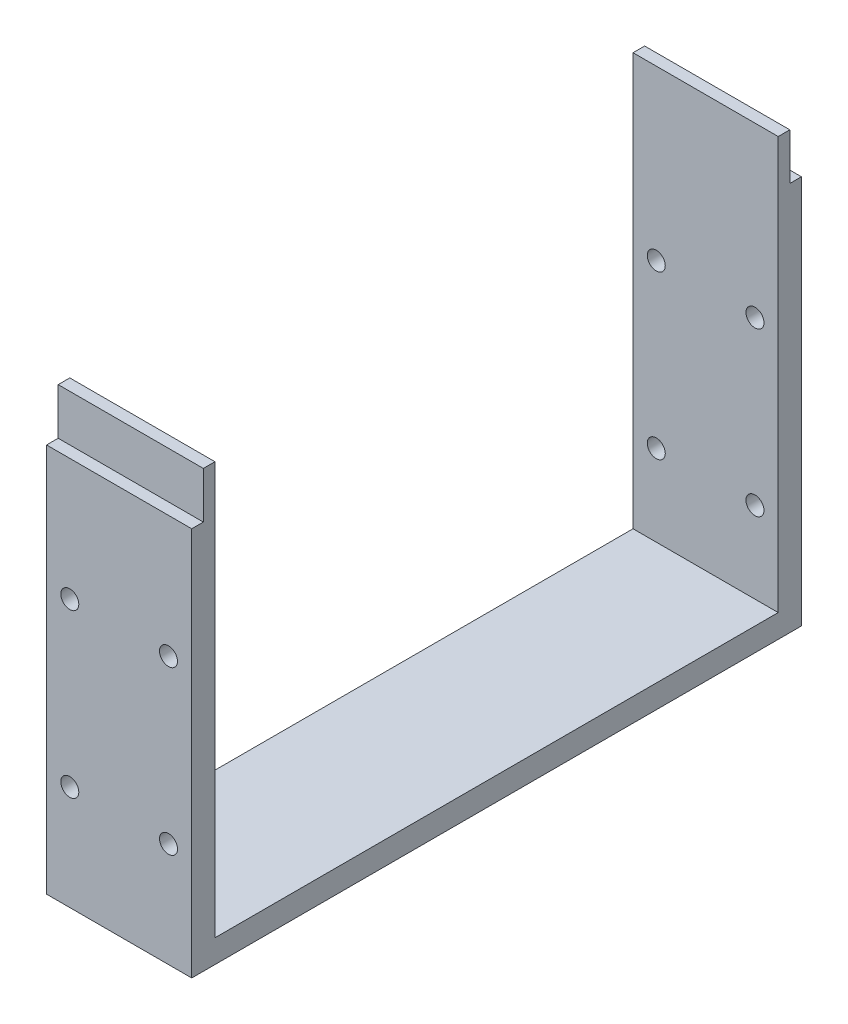
ISO-10303-21;
HEADER;
FILE_DESCRIPTION(('STEP AP214'),'2;1');
FILE_NAME('part.step','',(''),(''),'','','');
FILE_SCHEMA(('AUTOMOTIVE_DESIGN { 1 0 10303 214 1 1 1 1 }'));
ENDSEC;
DATA;
#1=APPLICATION_CONTEXT('core data for automotive mechanical design processes');
#2=APPLICATION_PROTOCOL_DEFINITION('international standard','automotive_design',2000,#1);
#3=PRODUCT_CONTEXT('',#1,'mechanical');
#4=PRODUCT('Part','Part','',(#3));
#5=PRODUCT_RELATED_PRODUCT_CATEGORY('part','',(#4));
#6=PRODUCT_DEFINITION_FORMATION('','',#4);
#7=PRODUCT_DEFINITION_CONTEXT('part definition',#1,'design');
#8=PRODUCT_DEFINITION('design','',#6,#7);
#9=PRODUCT_DEFINITION_SHAPE('','',#8);
#10=(LENGTH_UNIT() NAMED_UNIT(*) SI_UNIT(.MILLI.,.METRE.));
#11=(NAMED_UNIT(*) PLANE_ANGLE_UNIT() SI_UNIT($,.RADIAN.));
#12=(NAMED_UNIT(*) SI_UNIT($,.STERADIAN.) SOLID_ANGLE_UNIT());
#13=UNCERTAINTY_MEASURE_WITH_UNIT(LENGTH_MEASURE(1.E-05),#10,'distance_accuracy_value','');
#14=(GEOMETRIC_REPRESENTATION_CONTEXT(3) GLOBAL_UNCERTAINTY_ASSIGNED_CONTEXT((#13)) GLOBAL_UNIT_ASSIGNED_CONTEXT((#10,
#11,#12)) REPRESENTATION_CONTEXT('',''));
#15=CARTESIAN_POINT('',(0.,0.,0.));
#16=DIRECTION('',(0.,0.,1.));
#17=DIRECTION('',(1.,0.,0.));
#18=AXIS2_PLACEMENT_3D('',#15,#16,#17);
#19=CARTESIAN_POINT('',(12.5,65.,0.));
#20=DIRECTION('',(0.,-1.,0.));
#21=DIRECTION('',(0.,0.,-1.));
#22=AXIS2_PLACEMENT_3D('',#19,#20,#21);
#23=PLANE('',#22);
#24=DIRECTION('',(-1.,0.,0.));
#25=VECTOR('',#24,1.);
#26=CARTESIAN_POINT('',(12.5,65.,-50.5));
#27=LINE('',#26,#25);
#28=CARTESIAN_POINT('',(12.5,65.,-50.5));
#29=VERTEX_POINT('',#28);
#30=CARTESIAN_POINT('',(-12.5,65.,-50.5));
#31=VERTEX_POINT('',#30);
#32=EDGE_CURVE('E12',#29,#31,#27,.T.);
#33=ORIENTED_EDGE('',*,*,#32,.F.);
#34=DIRECTION('',(0.,0.,1.));
#35=VECTOR('',#34,1.);
#36=CARTESIAN_POINT('',(12.5,65.,0.));
#37=LINE('',#36,#35);
#38=CARTESIAN_POINT('',(12.5,65.,-52.5));
#39=VERTEX_POINT('',#38);
#40=EDGE_CURVE('E300',#39,#29,#37,.T.);
#41=ORIENTED_EDGE('',*,*,#40,.F.);
#42=DIRECTION('',(-1.,0.,0.));
#43=VECTOR('',#42,1.);
#44=CARTESIAN_POINT('',(12.5,65.,-52.5));
#45=LINE('',#44,#43);
#46=CARTESIAN_POINT('',(-12.5,65.,-52.5));
#47=VERTEX_POINT('',#46);
#48=EDGE_CURVE('E216',#39,#47,#45,.T.);
#49=ORIENTED_EDGE('',*,*,#48,.T.);
#50=DIRECTION('',(0.,0.,1.));
#51=VECTOR('',#50,1.);
#52=CARTESIAN_POINT('',(-12.5,65.,0.));
#53=LINE('',#52,#51);
#54=EDGE_CURVE('E182',#47,#31,#53,.T.);
#55=ORIENTED_EDGE('',*,*,#54,.T.);
#56=EDGE_LOOP('',(#33,#41,#49,#55));
#57=FACE_BOUND('',#56,.T.);
#58=ADVANCED_FACE('F113',(#57),#23,.F.);
#59=CARTESIAN_POINT('',(12.5,0.,-48.5));
#60=DIRECTION('',(0.,0.,1.));
#61=DIRECTION('',(1.,0.,0.));
#62=AXIS2_PLACEMENT_3D('',#59,#60,#61);
#63=PLANE('',#62);
#64=CARTESIAN_POINT('',(8.5,44.,-48.5));
#65=DIRECTION('',(0.,0.,1.));
#66=DIRECTION('',(1.,0.,0.));
#67=AXIS2_PLACEMENT_3D('',#64,#65,#66);
#68=CIRCLE('',#67,1.54999999999994);
#69=CARTESIAN_POINT('',(10.0499999999999,44.,-48.5));
#70=VERTEX_POINT('',#69);
#71=EDGE_CURVE('E194',#70,#70,#68,.T.);
#72=ORIENTED_EDGE('',*,*,#71,.F.);
#73=EDGE_LOOP('',(#72));
#74=FACE_BOUND('',#73,.T.);
#75=CARTESIAN_POINT('',(-8.5,16.,-48.5));
#76=DIRECTION('',(0.,0.,1.));
#77=DIRECTION('',(1.,0.,0.));
#78=AXIS2_PLACEMENT_3D('',#75,#76,#77);
#79=CIRCLE('',#78,1.55);
#80=CARTESIAN_POINT('',(-6.95,16.,-48.5));
#81=VERTEX_POINT('',#80);
#82=EDGE_CURVE('E310',#81,#81,#79,.T.);
#83=ORIENTED_EDGE('',*,*,#82,.F.);
#84=EDGE_LOOP('',(#83));
#85=FACE_BOUND('',#84,.T.);
#86=CARTESIAN_POINT('',(-8.5,44.,-48.5));
#87=DIRECTION('',(0.,0.,1.));
#88=DIRECTION('',(1.,0.,0.));
#89=AXIS2_PLACEMENT_3D('',#86,#87,#88);
#90=CIRCLE('',#89,1.54999999999994);
#91=CARTESIAN_POINT('',(-6.95000000000006,44.,-48.5));
#92=VERTEX_POINT('',#91);
#93=EDGE_CURVE('E318',#92,#92,#90,.T.);
#94=ORIENTED_EDGE('',*,*,#93,.F.);
#95=EDGE_LOOP('',(#94));
#96=FACE_BOUND('',#95,.T.);
#97=CARTESIAN_POINT('',(8.5,16.,-48.5));
#98=DIRECTION('',(0.,0.,1.));
#99=DIRECTION('',(1.,0.,0.));
#100=AXIS2_PLACEMENT_3D('',#97,#98,#99);
#101=CIRCLE('',#100,1.55);
#102=CARTESIAN_POINT('',(10.05,16.,-48.5));
#103=VERTEX_POINT('',#102);
#104=EDGE_CURVE('E326',#103,#103,#101,.T.);
#105=ORIENTED_EDGE('',*,*,#104,.F.);
#106=EDGE_LOOP('',(#105));
#107=FACE_BOUND('',#106,.T.);
#108=DIRECTION('',(0.,1.,0.));
#109=VECTOR('',#108,1.);
#110=CARTESIAN_POINT('',(-12.5,0.,-48.5));
#111=LINE('',#110,#109);
#112=CARTESIAN_POINT('',(-12.5,2.,-48.5));
#113=VERTEX_POINT('',#112);
#114=CARTESIAN_POINT('',(-12.5,73.,-48.5));
#115=VERTEX_POINT('',#114);
#116=EDGE_CURVE('E169',#113,#115,#111,.T.);
#117=ORIENTED_EDGE('',*,*,#116,.F.);
#118=DIRECTION('',(-1.,0.,0.));
#119=VECTOR('',#118,1.);
#120=CARTESIAN_POINT('',(12.5,2.,-48.5));
#121=LINE('',#120,#119);
#122=CARTESIAN_POINT('',(12.5,2.,-48.5));
#123=VERTEX_POINT('',#122);
#124=EDGE_CURVE('E236',#123,#113,#121,.T.);
#125=ORIENTED_EDGE('',*,*,#124,.F.);
#126=DIRECTION('',(0.,1.,0.));
#127=VECTOR('',#126,1.);
#128=CARTESIAN_POINT('',(12.5,0.,-48.5));
#129=LINE('',#128,#127);
#130=CARTESIAN_POINT('',(12.5,73.,-48.5));
#131=VERTEX_POINT('',#130);
#132=EDGE_CURVE('E188',#123,#131,#129,.T.);
#133=ORIENTED_EDGE('',*,*,#132,.T.);
#134=DIRECTION('',(-1.,0.,0.));
#135=VECTOR('',#134,1.);
#136=CARTESIAN_POINT('',(12.5,73.,-48.5));
#137=LINE('',#136,#135);
#138=EDGE_CURVE('E185',#131,#115,#137,.T.);
#139=ORIENTED_EDGE('',*,*,#138,.T.);
#140=EDGE_LOOP('',(#117,#125,#133,#139));
#141=FACE_BOUND('',#140,.T.);
#142=ADVANCED_FACE('F186',(#74,#85,#96,#107,#141),#63,.T.);
#143=CARTESIAN_POINT('',(12.5,2.,0.));
#144=DIRECTION('',(0.,1.,0.));
#145=DIRECTION('',(0.,0.,1.));
#146=AXIS2_PLACEMENT_3D('',#143,#144,#145);
#147=PLANE('',#146);
#148=DIRECTION('',(0.,0.,-1.));
#149=VECTOR('',#148,1.);
#150=CARTESIAN_POINT('',(-12.5,2.,0.));
#151=LINE('',#150,#149);
#152=CARTESIAN_POINT('',(-12.5,2.,48.5));
#153=VERTEX_POINT('',#152);
#154=EDGE_CURVE('E178',#153,#113,#151,.T.);
#155=ORIENTED_EDGE('',*,*,#154,.F.);
#156=DIRECTION('',(-1.,0.,0.));
#157=VECTOR('',#156,1.);
#158=CARTESIAN_POINT('',(12.5,2.,48.5));
#159=LINE('',#158,#157);
#160=CARTESIAN_POINT('',(12.5,2.,48.5));
#161=VERTEX_POINT('',#160);
#162=EDGE_CURVE('E240',#161,#153,#159,.T.);
#163=ORIENTED_EDGE('',*,*,#162,.F.);
#164=DIRECTION('',(0.,0.,-1.));
#165=VECTOR('',#164,1.);
#166=CARTESIAN_POINT('',(12.5,2.,0.));
#167=LINE('',#166,#165);
#168=EDGE_CURVE('E294',#161,#123,#167,.T.);
#169=ORIENTED_EDGE('',*,*,#168,.T.);
#170=ORIENTED_EDGE('',*,*,#124,.T.);
#171=EDGE_LOOP('',(#155,#163,#169,#170));
#172=FACE_BOUND('',#171,.T.);
#173=ADVANCED_FACE('F436',(#172),#147,.T.);
#174=CARTESIAN_POINT('',(12.5,0.,48.5));
#175=DIRECTION('',(0.,0.,1.));
#176=DIRECTION('',(1.,0.,0.));
#177=AXIS2_PLACEMENT_3D('',#174,#175,#176);
#178=PLANE('',#177);
#179=CARTESIAN_POINT('',(8.5,44.,48.5));
#180=DIRECTION('',(0.,0.,1.));
#181=DIRECTION('',(1.,0.,0.));
#182=AXIS2_PLACEMENT_3D('',#179,#180,#181);
#183=CIRCLE('',#182,1.54999999999994);
#184=CARTESIAN_POINT('',(10.0499999999999,44.,48.5));
#185=VERTEX_POINT('',#184);
#186=EDGE_CURVE('E201',#185,#185,#183,.T.);
#187=ORIENTED_EDGE('',*,*,#186,.T.);
#188=EDGE_LOOP('',(#187));
#189=FACE_BOUND('',#188,.T.);
#190=CARTESIAN_POINT('',(-8.5,16.,48.5));
#191=DIRECTION('',(0.,0.,1.));
#192=DIRECTION('',(1.,0.,0.));
#193=AXIS2_PLACEMENT_3D('',#190,#191,#192);
#194=CIRCLE('',#193,1.55);
#195=CARTESIAN_POINT('',(-6.95,16.,48.5));
#196=VERTEX_POINT('',#195);
#197=EDGE_CURVE('E314',#196,#196,#194,.T.);
#198=ORIENTED_EDGE('',*,*,#197,.T.);
#199=EDGE_LOOP('',(#198));
#200=FACE_BOUND('',#199,.T.);
#201=CARTESIAN_POINT('',(-8.5,44.,48.5));
#202=DIRECTION('',(0.,0.,1.));
#203=DIRECTION('',(1.,0.,0.));
#204=AXIS2_PLACEMENT_3D('',#201,#202,#203);
#205=CIRCLE('',#204,1.54999999999994);
#206=CARTESIAN_POINT('',(-6.95000000000006,44.,48.5));
#207=VERTEX_POINT('',#206);
#208=EDGE_CURVE('E322',#207,#207,#205,.T.);
#209=ORIENTED_EDGE('',*,*,#208,.T.);
#210=EDGE_LOOP('',(#209));
#211=FACE_BOUND('',#210,.T.);
#212=CARTESIAN_POINT('',(8.5,16.,48.5));
#213=DIRECTION('',(0.,0.,1.));
#214=DIRECTION('',(1.,0.,0.));
#215=AXIS2_PLACEMENT_3D('',#212,#213,#214);
#216=CIRCLE('',#215,1.55);
#217=CARTESIAN_POINT('',(10.05,16.,48.5));
#218=VERTEX_POINT('',#217);
#219=EDGE_CURVE('E330',#218,#218,#216,.T.);
#220=ORIENTED_EDGE('',*,*,#219,.T.);
#221=EDGE_LOOP('',(#220));
#222=FACE_BOUND('',#221,.T.);
#223=DIRECTION('',(0.,1.,0.));
#224=VECTOR('',#223,1.);
#225=CARTESIAN_POINT('',(-12.5,0.,48.5));
#226=LINE('',#225,#224);
#227=CARTESIAN_POINT('',(-12.5,73.,48.5));
#228=VERTEX_POINT('',#227);
#229=EDGE_CURVE('E270',#153,#228,#226,.T.);
#230=ORIENTED_EDGE('',*,*,#229,.T.);
#231=DIRECTION('',(-1.,0.,0.));
#232=VECTOR('',#231,1.);
#233=CARTESIAN_POINT('',(12.5,73.,48.5));
#234=LINE('',#233,#232);
#235=CARTESIAN_POINT('',(12.5,73.,48.5));
#236=VERTEX_POINT('',#235);
#237=EDGE_CURVE('E213',#236,#228,#234,.T.);
#238=ORIENTED_EDGE('',*,*,#237,.F.);
#239=DIRECTION('',(0.,1.,0.));
#240=VECTOR('',#239,1.);
#241=CARTESIAN_POINT('',(12.5,0.,48.5));
#242=LINE('',#241,#240);
#243=EDGE_CURVE('E291',#161,#236,#242,.T.);
#244=ORIENTED_EDGE('',*,*,#243,.F.);
#245=ORIENTED_EDGE('',*,*,#162,.T.);
#246=EDGE_LOOP('',(#230,#238,#244,#245));
#247=FACE_BOUND('',#246,.T.);
#248=ADVANCED_FACE('F431',(#189,#200,#211,#222,#247),#178,.F.);
#249=CARTESIAN_POINT('',(12.5,65.,0.));
#250=DIRECTION('',(0.,1.,0.));
#251=DIRECTION('',(0.,0.,1.));
#252=AXIS2_PLACEMENT_3D('',#249,#250,#251);
#253=PLANE('',#252);
#254=DIRECTION('',(0.,0.,-1.));
#255=VECTOR('',#254,1.);
#256=CARTESIAN_POINT('',(12.5,65.,0.));
#257=LINE('',#256,#255);
#258=CARTESIAN_POINT('',(12.5,65.,52.5));
#259=VERTEX_POINT('',#258);
#260=CARTESIAN_POINT('',(12.5,65.,50.5));
#261=VERTEX_POINT('',#260);
#262=EDGE_CURVE('E287',#259,#261,#257,.T.);
#263=ORIENTED_EDGE('',*,*,#262,.T.);
#264=DIRECTION('',(-1.,0.,0.));
#265=VECTOR('',#264,1.);
#266=CARTESIAN_POINT('',(12.5,65.,50.5));
#267=LINE('',#266,#265);
#268=CARTESIAN_POINT('',(-12.5,65.,50.5));
#269=VERTEX_POINT('',#268);
#270=EDGE_CURVE('E124',#261,#269,#267,.T.);
#271=ORIENTED_EDGE('',*,*,#270,.T.);
#272=DIRECTION('',(0.,0.,-1.));
#273=VECTOR('',#272,1.);
#274=CARTESIAN_POINT('',(-12.5,65.,0.));
#275=LINE('',#274,#273);
#276=CARTESIAN_POINT('',(-12.5,65.,52.5));
#277=VERTEX_POINT('',#276);
#278=EDGE_CURVE('E266',#277,#269,#275,.T.);
#279=ORIENTED_EDGE('',*,*,#278,.F.);
#280=DIRECTION('',(-1.,0.,0.));
#281=VECTOR('',#280,1.);
#282=CARTESIAN_POINT('',(12.5,65.,52.5));
#283=LINE('',#282,#281);
#284=EDGE_CURVE('E244',#259,#277,#283,.T.);
#285=ORIENTED_EDGE('',*,*,#284,.F.);
#286=EDGE_LOOP('',(#263,#271,#279,#285));
#287=FACE_BOUND('',#286,.T.);
#288=ADVANCED_FACE('F421',(#287),#253,.T.);
#289=CARTESIAN_POINT('',(12.5,0.,52.5));
#290=DIRECTION('',(0.,0.,-1.));
#291=DIRECTION('',(-1.,0.,0.));
#292=AXIS2_PLACEMENT_3D('',#289,#290,#291);
#293=PLANE('',#292);
#294=CARTESIAN_POINT('',(8.5,44.,52.5));
#295=DIRECTION('',(0.,0.,-1.));
#296=DIRECTION('',(-1.,0.,0.));
#297=AXIS2_PLACEMENT_3D('',#294,#295,#296);
#298=CIRCLE('',#297,1.54999999999994);
#299=CARTESIAN_POINT('',(6.95000000000006,44.,52.5));
#300=VERTEX_POINT('',#299);
#301=EDGE_CURVE('E342',#300,#300,#298,.T.);
#302=ORIENTED_EDGE('',*,*,#301,.T.);
#303=EDGE_LOOP('',(#302));
#304=FACE_BOUND('',#303,.T.);
#305=CARTESIAN_POINT('',(-8.5,16.,52.5));
#306=DIRECTION('',(0.,0.,-1.));
#307=DIRECTION('',(1.,0.,0.));
#308=AXIS2_PLACEMENT_3D('',#305,#306,#307);
#309=CIRCLE('',#308,1.55);
#310=CARTESIAN_POINT('',(-6.95,16.,52.5));
#311=VERTEX_POINT('',#310);
#312=EDGE_CURVE('E343',#311,#311,#309,.T.);
#313=ORIENTED_EDGE('',*,*,#312,.T.);
#314=EDGE_LOOP('',(#313));
#315=FACE_BOUND('',#314,.T.);
#316=CARTESIAN_POINT('',(-8.5,44.,52.5));
#317=DIRECTION('',(0.,0.,-1.));
#318=DIRECTION('',(1.,0.,0.));
#319=AXIS2_PLACEMENT_3D('',#316,#317,#318);
#320=CIRCLE('',#319,1.54999999999994);
#321=CARTESIAN_POINT('',(-6.95000000000006,44.,52.5));
#322=VERTEX_POINT('',#321);
#323=EDGE_CURVE('E352',#322,#322,#320,.T.);
#324=ORIENTED_EDGE('',*,*,#323,.T.);
#325=EDGE_LOOP('',(#324));
#326=FACE_BOUND('',#325,.T.);
#327=CARTESIAN_POINT('',(8.5,16.,52.5));
#328=DIRECTION('',(0.,0.,-1.));
#329=DIRECTION('',(-1.,0.,0.));
#330=AXIS2_PLACEMENT_3D('',#327,#328,#329);
#331=CIRCLE('',#330,1.55);
#332=CARTESIAN_POINT('',(6.95,16.,52.5));
#333=VERTEX_POINT('',#332);
#334=EDGE_CURVE('E334',#333,#333,#331,.T.);
#335=ORIENTED_EDGE('',*,*,#334,.T.);
#336=EDGE_LOOP('',(#335));
#337=FACE_BOUND('',#336,.T.);
#338=DIRECTION('',(0.,-1.,0.));
#339=VECTOR('',#338,1.);
#340=CARTESIAN_POINT('',(-12.5,0.,52.5));
#341=LINE('',#340,#339);
#342=CARTESIAN_POINT('',(-12.5,-2.,52.5));
#343=VERTEX_POINT('',#342);
#344=EDGE_CURVE('E262',#277,#343,#341,.T.);
#345=ORIENTED_EDGE('',*,*,#344,.T.);
#346=DIRECTION('',(-1.,0.,0.));
#347=VECTOR('',#346,1.);
#348=CARTESIAN_POINT('',(12.5,-2.,52.5));
#349=LINE('',#348,#347);
#350=CARTESIAN_POINT('',(12.5,-2.,52.5));
#351=VERTEX_POINT('',#350);
#352=EDGE_CURVE('E248',#351,#343,#349,.T.);
#353=ORIENTED_EDGE('',*,*,#352,.F.);
#354=DIRECTION('',(0.,-1.,0.));
#355=VECTOR('',#354,1.);
#356=CARTESIAN_POINT('',(12.5,0.,52.5));
#357=LINE('',#356,#355);
#358=EDGE_CURVE('E283',#259,#351,#357,.T.);
#359=ORIENTED_EDGE('',*,*,#358,.F.);
#360=ORIENTED_EDGE('',*,*,#284,.T.);
#361=EDGE_LOOP('',(#345,#353,#359,#360));
#362=FACE_BOUND('',#361,.T.);
#363=ADVANCED_FACE('F416',(#304,#315,#326,#337,#362),#293,.F.);
#364=CARTESIAN_POINT('',(12.5,-2.,0.));
#365=DIRECTION('',(0.,1.,0.));
#366=DIRECTION('',(0.,0.,1.));
#367=AXIS2_PLACEMENT_3D('',#364,#365,#366);
#368=PLANE('',#367);
#369=DIRECTION('',(0.,0.,-1.));
#370=VECTOR('',#369,1.);
#371=CARTESIAN_POINT('',(-12.5,-2.,0.));
#372=LINE('',#371,#370);
#373=CARTESIAN_POINT('',(-12.5,-2.,-52.5));
#374=VERTEX_POINT('',#373);
#375=EDGE_CURVE('E257',#343,#374,#372,.T.);
#376=ORIENTED_EDGE('',*,*,#375,.T.);
#377=DIRECTION('',(-1.,0.,0.));
#378=VECTOR('',#377,1.);
#379=CARTESIAN_POINT('',(12.5,-2.,-52.5));
#380=LINE('',#379,#378);
#381=CARTESIAN_POINT('',(12.5,-2.,-52.5));
#382=VERTEX_POINT('',#381);
#383=EDGE_CURVE('E252',#382,#374,#380,.T.);
#384=ORIENTED_EDGE('',*,*,#383,.F.);
#385=DIRECTION('',(0.,0.,-1.));
#386=VECTOR('',#385,1.);
#387=CARTESIAN_POINT('',(12.5,-2.,0.));
#388=LINE('',#387,#386);
#389=EDGE_CURVE('E256',#351,#382,#388,.T.);
#390=ORIENTED_EDGE('',*,*,#389,.F.);
#391=ORIENTED_EDGE('',*,*,#352,.T.);
#392=EDGE_LOOP('',(#376,#384,#390,#391));
#393=FACE_BOUND('',#392,.T.);
#394=ADVANCED_FACE('F372',(#393),#368,.F.);
#395=CARTESIAN_POINT('',(12.5,0.,-52.5));
#396=DIRECTION('',(0.,0.,-1.));
#397=DIRECTION('',(-1.,0.,0.));
#398=AXIS2_PLACEMENT_3D('',#395,#396,#397);
#399=PLANE('',#398);
#400=CARTESIAN_POINT('',(8.5,44.,-52.5));
#401=DIRECTION('',(0.,0.,-1.));
#402=DIRECTION('',(-1.,0.,0.));
#403=AXIS2_PLACEMENT_3D('',#400,#401,#402);
#404=CIRCLE('',#403,1.54999999999994);
#405=CARTESIAN_POINT('',(6.95000000000006,44.,-52.5));
#406=VERTEX_POINT('',#405);
#407=EDGE_CURVE('E347',#406,#406,#404,.T.);
#408=ORIENTED_EDGE('',*,*,#407,.F.);
#409=EDGE_LOOP('',(#408));
#410=FACE_BOUND('',#409,.T.);
#411=CARTESIAN_POINT('',(-8.5,16.,-52.5));
#412=DIRECTION('',(0.,0.,-1.));
#413=DIRECTION('',(1.,0.,0.));
#414=AXIS2_PLACEMENT_3D('',#411,#412,#413);
#415=CIRCLE('',#414,1.55);
#416=CARTESIAN_POINT('',(-6.95,16.,-52.5));
#417=VERTEX_POINT('',#416);
#418=EDGE_CURVE('E348',#417,#417,#415,.T.);
#419=ORIENTED_EDGE('',*,*,#418,.F.);
#420=EDGE_LOOP('',(#419));
#421=FACE_BOUND('',#420,.T.);
#422=CARTESIAN_POINT('',(-8.5,44.,-52.5));
#423=DIRECTION('',(0.,0.,-1.));
#424=DIRECTION('',(1.,0.,0.));
#425=AXIS2_PLACEMENT_3D('',#422,#423,#424);
#426=CIRCLE('',#425,1.54999999999994);
#427=CARTESIAN_POINT('',(-6.95000000000006,44.,-52.5));
#428=VERTEX_POINT('',#427);
#429=EDGE_CURVE('E362',#428,#428,#426,.T.);
#430=ORIENTED_EDGE('',*,*,#429,.F.);
#431=EDGE_LOOP('',(#430));
#432=FACE_BOUND('',#431,.T.);
#433=CARTESIAN_POINT('',(8.5,16.,-52.5));
#434=DIRECTION('',(0.,0.,-1.));
#435=DIRECTION('',(-1.,0.,0.));
#436=AXIS2_PLACEMENT_3D('',#433,#434,#435);
#437=CIRCLE('',#436,1.55);
#438=CARTESIAN_POINT('',(6.95,16.,-52.5));
#439=VERTEX_POINT('',#438);
#440=EDGE_CURVE('E338',#439,#439,#437,.T.);
#441=ORIENTED_EDGE('',*,*,#440,.F.);
#442=EDGE_LOOP('',(#441));
#443=FACE_BOUND('',#442,.T.);
#444=DIRECTION('',(0.,-1.,0.));
#445=VECTOR('',#444,1.);
#446=CARTESIAN_POINT('',(-12.5,0.,-52.5));
#447=LINE('',#446,#445);
#448=EDGE_CURVE('E212',#47,#374,#447,.T.);
#449=ORIENTED_EDGE('',*,*,#448,.F.);
#450=ORIENTED_EDGE('',*,*,#48,.F.);
#451=DIRECTION('',(0.,-1.,0.));
#452=VECTOR('',#451,1.);
#453=CARTESIAN_POINT('',(12.5,0.,-52.5));
#454=LINE('',#453,#452);
#455=EDGE_CURVE('E261',#39,#382,#454,.T.);
#456=ORIENTED_EDGE('',*,*,#455,.T.);
#457=ORIENTED_EDGE('',*,*,#383,.T.);
#458=EDGE_LOOP('',(#449,#450,#456,#457));
#459=FACE_BOUND('',#458,.T.);
#460=ADVANCED_FACE('F369',(#410,#421,#432,#443,#459),#399,.T.);
#461=CARTESIAN_POINT('',(-12.5,0.,0.));
#462=DIRECTION('',(1.,0.,0.));
#463=DIRECTION('',(0.,0.,-1.));
#464=AXIS2_PLACEMENT_3D('',#461,#462,#463);
#465=PLANE('',#464);
#466=ORIENTED_EDGE('',*,*,#448,.T.);
#467=ORIENTED_EDGE('',*,*,#375,.F.);
#468=ORIENTED_EDGE('',*,*,#344,.F.);
#469=ORIENTED_EDGE('',*,*,#278,.T.);
#470=DIRECTION('',(0.,1.,0.));
#471=VECTOR('',#470,1.);
#472=CARTESIAN_POINT('',(-12.5,65.,50.5));
#473=LINE('',#472,#471);
#474=CARTESIAN_POINT('',(-12.5,73.,50.5));
#475=VERTEX_POINT('',#474);
#476=EDGE_CURVE('E221',#269,#475,#473,.T.);
#477=ORIENTED_EDGE('',*,*,#476,.T.);
#478=DIRECTION('',(0.,0.,1.));
#479=VECTOR('',#478,1.);
#480=CARTESIAN_POINT('',(-12.5,73.,48.5));
#481=LINE('',#480,#479);
#482=EDGE_CURVE('E191',#228,#475,#481,.T.);
#483=ORIENTED_EDGE('',*,*,#482,.F.);
#484=ORIENTED_EDGE('',*,*,#229,.F.);
#485=ORIENTED_EDGE('',*,*,#154,.T.);
#486=ORIENTED_EDGE('',*,*,#116,.T.);
#487=DIRECTION('',(0.,0.,-1.));
#488=VECTOR('',#487,1.);
#489=CARTESIAN_POINT('',(-12.5,73.,-48.5));
#490=LINE('',#489,#488);
#491=CARTESIAN_POINT('',(-12.5,73.,-50.5));
#492=VERTEX_POINT('',#491);
#493=EDGE_CURVE('E174',#115,#492,#490,.T.);
#494=ORIENTED_EDGE('',*,*,#493,.T.);
#495=DIRECTION('',(0.,1.,0.));
#496=VECTOR('',#495,1.);
#497=CARTESIAN_POINT('',(-12.5,65.,-50.5));
#498=LINE('',#497,#496);
#499=EDGE_CURVE('E193',#31,#492,#498,.T.);
#500=ORIENTED_EDGE('',*,*,#499,.F.);
#501=ORIENTED_EDGE('',*,*,#54,.F.);
#502=EDGE_LOOP('',(#466,#467,#468,#469,#477,#483,#484,#485,#486,#494,#500,#501));
#503=FACE_BOUND('',#502,.T.);
#504=ADVANCED_FACE('F172',(#503),#465,.F.);
#505=CARTESIAN_POINT('',(12.5,0.,0.));
#506=DIRECTION('',(1.,0.,0.));
#507=DIRECTION('',(0.,0.,-1.));
#508=AXIS2_PLACEMENT_3D('',#505,#506,#507);
#509=PLANE('',#508);
#510=ORIENTED_EDGE('',*,*,#455,.F.);
#511=ORIENTED_EDGE('',*,*,#40,.T.);
#512=DIRECTION('',(0.,1.,0.));
#513=VECTOR('',#512,1.);
#514=CARTESIAN_POINT('',(12.5,65.,-50.5));
#515=LINE('',#514,#513);
#516=CARTESIAN_POINT('',(12.5,73.,-50.5));
#517=VERTEX_POINT('',#516);
#518=EDGE_CURVE('E204',#29,#517,#515,.T.);
#519=ORIENTED_EDGE('',*,*,#518,.T.);
#520=DIRECTION('',(0.,0.,-1.));
#521=VECTOR('',#520,1.);
#522=CARTESIAN_POINT('',(12.5,73.,-48.5));
#523=LINE('',#522,#521);
#524=EDGE_CURVE('E198',#131,#517,#523,.T.);
#525=ORIENTED_EDGE('',*,*,#524,.F.);
#526=ORIENTED_EDGE('',*,*,#132,.F.);
#527=ORIENTED_EDGE('',*,*,#168,.F.);
#528=ORIENTED_EDGE('',*,*,#243,.T.);
#529=DIRECTION('',(0.,0.,1.));
#530=VECTOR('',#529,1.);
#531=CARTESIAN_POINT('',(12.5,73.,48.5));
#532=LINE('',#531,#530);
#533=CARTESIAN_POINT('',(12.5,73.,50.5));
#534=VERTEX_POINT('',#533);
#535=EDGE_CURVE('E225',#236,#534,#532,.T.);
#536=ORIENTED_EDGE('',*,*,#535,.T.);
#537=DIRECTION('',(0.,1.,0.));
#538=VECTOR('',#537,1.);
#539=CARTESIAN_POINT('',(12.5,65.,50.5));
#540=LINE('',#539,#538);
#541=EDGE_CURVE('E220',#261,#534,#540,.T.);
#542=ORIENTED_EDGE('',*,*,#541,.F.);
#543=ORIENTED_EDGE('',*,*,#262,.F.);
#544=ORIENTED_EDGE('',*,*,#358,.T.);
#545=ORIENTED_EDGE('',*,*,#389,.T.);
#546=EDGE_LOOP('',(#510,#511,#519,#525,#526,#527,#528,#536,#542,#543,#544,#545));
#547=FACE_BOUND('',#546,.T.);
#548=ADVANCED_FACE('F403',(#547),#509,.T.);
#549=CARTESIAN_POINT('',(12.5,65.,-50.5));
#550=DIRECTION('',(0.,0.,1.));
#551=DIRECTION('',(1.,0.,0.));
#552=AXIS2_PLACEMENT_3D('',#549,#550,#551);
#553=PLANE('',#552);
#554=ORIENTED_EDGE('',*,*,#499,.T.);
#555=DIRECTION('',(-1.,0.,0.));
#556=VECTOR('',#555,1.);
#557=CARTESIAN_POINT('',(12.5,73.,-50.5));
#558=LINE('',#557,#556);
#559=EDGE_CURVE('E117',#517,#492,#558,.T.);
#560=ORIENTED_EDGE('',*,*,#559,.F.);
#561=ORIENTED_EDGE('',*,*,#518,.F.);
#562=ORIENTED_EDGE('',*,*,#32,.T.);
#563=EDGE_LOOP('',(#554,#560,#561,#562));
#564=FACE_BOUND('',#563,.T.);
#565=ADVANCED_FACE('F399',(#564),#553,.F.);
#566=CARTESIAN_POINT('',(12.5,73.,-48.5));
#567=DIRECTION('',(0.,1.,0.));
#568=DIRECTION('',(0.,0.,1.));
#569=AXIS2_PLACEMENT_3D('',#566,#567,#568);
#570=PLANE('',#569);
#571=ORIENTED_EDGE('',*,*,#493,.F.);
#572=ORIENTED_EDGE('',*,*,#138,.F.);
#573=ORIENTED_EDGE('',*,*,#524,.T.);
#574=ORIENTED_EDGE('',*,*,#559,.T.);
#575=EDGE_LOOP('',(#571,#572,#573,#574));
#576=FACE_BOUND('',#575,.T.);
#577=ADVANCED_FACE('F115',(#576),#570,.T.);
#578=CARTESIAN_POINT('',(12.5,65.,50.5));
#579=DIRECTION('',(0.,0.,1.));
#580=DIRECTION('',(1.,0.,0.));
#581=AXIS2_PLACEMENT_3D('',#578,#579,#580);
#582=PLANE('',#581);
#583=ORIENTED_EDGE('',*,*,#476,.F.);
#584=ORIENTED_EDGE('',*,*,#270,.F.);
#585=ORIENTED_EDGE('',*,*,#541,.T.);
#586=DIRECTION('',(-1.,0.,0.));
#587=VECTOR('',#586,1.);
#588=CARTESIAN_POINT('',(12.5,73.,50.5));
#589=LINE('',#588,#587);
#590=EDGE_CURVE('E209',#534,#475,#589,.T.);
#591=ORIENTED_EDGE('',*,*,#590,.T.);
#592=EDGE_LOOP('',(#583,#584,#585,#591));
#593=FACE_BOUND('',#592,.T.);
#594=ADVANCED_FACE('F422',(#593),#582,.T.);
#595=CARTESIAN_POINT('',(12.5,73.,48.5));
#596=DIRECTION('',(0.,-1.,0.));
#597=DIRECTION('',(0.,0.,-1.));
#598=AXIS2_PLACEMENT_3D('',#595,#596,#597);
#599=PLANE('',#598);
#600=ORIENTED_EDGE('',*,*,#482,.T.);
#601=ORIENTED_EDGE('',*,*,#590,.F.);
#602=ORIENTED_EDGE('',*,*,#535,.F.);
#603=ORIENTED_EDGE('',*,*,#237,.T.);
#604=EDGE_LOOP('',(#600,#601,#602,#603));
#605=FACE_BOUND('',#604,.T.);
#606=ADVANCED_FACE('F426',(#605),#599,.F.);
#607=CARTESIAN_POINT('',(8.5,16.,52.5));
#608=DIRECTION('',(0.,0.,-1.));
#609=DIRECTION('',(-1.,0.,0.));
#610=AXIS2_PLACEMENT_3D('',#607,#608,#609);
#611=CYLINDRICAL_SURFACE('',#610,1.55);
#612=ORIENTED_EDGE('',*,*,#104,.T.);
#613=EDGE_LOOP('',(#612));
#614=FACE_BOUND('',#613,.T.);
#615=ORIENTED_EDGE('',*,*,#440,.T.);
#616=EDGE_LOOP('',(#615));
#617=FACE_BOUND('',#616,.T.);
#618=ADVANCED_FACE('F455',(#614,#617),#611,.F.);
#619=CARTESIAN_POINT('',(-8.5,44.,52.5));
#620=DIRECTION('',(0.,0.,-1.));
#621=DIRECTION('',(-1.,0.,0.));
#622=AXIS2_PLACEMENT_3D('',#619,#620,#621);
#623=CYLINDRICAL_SURFACE('',#622,1.54999999999994);
#624=ORIENTED_EDGE('',*,*,#93,.T.);
#625=EDGE_LOOP('',(#624));
#626=FACE_BOUND('',#625,.T.);
#627=ORIENTED_EDGE('',*,*,#429,.T.);
#628=EDGE_LOOP('',(#627));
#629=FACE_BOUND('',#628,.T.);
#630=ADVANCED_FACE('F367',(#626,#629),#623,.F.);
#631=CARTESIAN_POINT('',(-8.5,16.,52.5));
#632=DIRECTION('',(0.,0.,-1.));
#633=DIRECTION('',(-1.,0.,0.));
#634=AXIS2_PLACEMENT_3D('',#631,#632,#633);
#635=CYLINDRICAL_SURFACE('',#634,1.55);
#636=ORIENTED_EDGE('',*,*,#82,.T.);
#637=EDGE_LOOP('',(#636));
#638=FACE_BOUND('',#637,.T.);
#639=ORIENTED_EDGE('',*,*,#418,.T.);
#640=EDGE_LOOP('',(#639));
#641=FACE_BOUND('',#640,.T.);
#642=ADVANCED_FACE('F479',(#638,#641),#635,.F.);
#643=CARTESIAN_POINT('',(8.5,44.,52.5));
#644=DIRECTION('',(0.,0.,-1.));
#645=DIRECTION('',(-1.,0.,0.));
#646=AXIS2_PLACEMENT_3D('',#643,#644,#645);
#647=CYLINDRICAL_SURFACE('',#646,1.54999999999994);
#648=ORIENTED_EDGE('',*,*,#71,.T.);
#649=EDGE_LOOP('',(#648));
#650=FACE_BOUND('',#649,.T.);
#651=ORIENTED_EDGE('',*,*,#407,.T.);
#652=EDGE_LOOP('',(#651));
#653=FACE_BOUND('',#652,.T.);
#654=ADVANCED_FACE('F486',(#650,#653),#647,.F.);
#655=ORIENTED_EDGE('',*,*,#334,.F.);
#656=EDGE_LOOP('',(#655));
#657=FACE_BOUND('',#656,.T.);
#658=ORIENTED_EDGE('',*,*,#219,.F.);
#659=EDGE_LOOP('',(#658));
#660=FACE_BOUND('',#659,.T.);
#661=ADVANCED_FACE('F475',(#657,#660),#611,.F.);
#662=ORIENTED_EDGE('',*,*,#323,.F.);
#663=EDGE_LOOP('',(#662));
#664=FACE_BOUND('',#663,.T.);
#665=ORIENTED_EDGE('',*,*,#208,.F.);
#666=EDGE_LOOP('',(#665));
#667=FACE_BOUND('',#666,.T.);
#668=ADVANCED_FACE('F482',(#664,#667),#623,.F.);
#669=ORIENTED_EDGE('',*,*,#312,.F.);
#670=EDGE_LOOP('',(#669));
#671=FACE_BOUND('',#670,.T.);
#672=ORIENTED_EDGE('',*,*,#197,.F.);
#673=EDGE_LOOP('',(#672));
#674=FACE_BOUND('',#673,.T.);
#675=ADVANCED_FACE('F492',(#671,#674),#635,.F.);
#676=ORIENTED_EDGE('',*,*,#301,.F.);
#677=EDGE_LOOP('',(#676));
#678=FACE_BOUND('',#677,.T.);
#679=ORIENTED_EDGE('',*,*,#186,.F.);
#680=EDGE_LOOP('',(#679));
#681=FACE_BOUND('',#680,.T.);
#682=ADVANCED_FACE('F496',(#678,#681),#647,.F.);
#683=CLOSED_SHELL('',(#58,#142,#173,#248,#288,#363,#394,#460,#504,#548,#565,#577,#594,#606,#618,
#630,#642,#654,#661,#668,#675,#682));
#684=MANIFOLD_SOLID_BREP('B2',#683);
#685=ADVANCED_BREP_SHAPE_REPRESENTATION('',(#18,#684),#14);
#686=SHAPE_DEFINITION_REPRESENTATION(#9,#685);
ENDSEC;
END-ISO-10303-21;
